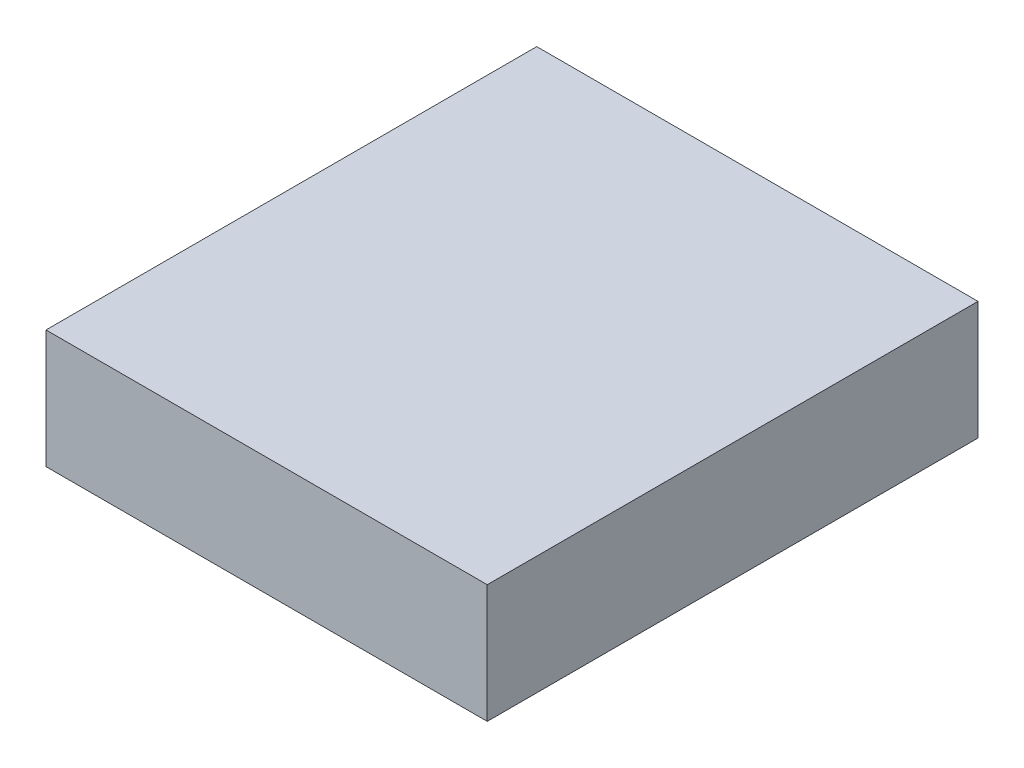
ISO-10303-21;
HEADER;
FILE_DESCRIPTION(('STEP AP214'),'2;1');
FILE_NAME('part.step','',(''),(''),'','','');
FILE_SCHEMA(('AUTOMOTIVE_DESIGN { 1 0 10303 214 1 1 1 1 }'));
ENDSEC;
DATA;
#1=APPLICATION_CONTEXT('core data for automotive mechanical design processes');
#2=APPLICATION_PROTOCOL_DEFINITION('international standard','automotive_design',2000,#1);
#3=PRODUCT_CONTEXT('',#1,'mechanical');
#4=PRODUCT('Part','Part','',(#3));
#5=PRODUCT_RELATED_PRODUCT_CATEGORY('part','',(#4));
#6=PRODUCT_DEFINITION_FORMATION('','',#4);
#7=PRODUCT_DEFINITION_CONTEXT('part definition',#1,'design');
#8=PRODUCT_DEFINITION('design','',#6,#7);
#9=PRODUCT_DEFINITION_SHAPE('','',#8);
#10=(LENGTH_UNIT() NAMED_UNIT(*) SI_UNIT(.MILLI.,.METRE.));
#11=(NAMED_UNIT(*) PLANE_ANGLE_UNIT() SI_UNIT($,.RADIAN.));
#12=(NAMED_UNIT(*) SI_UNIT($,.STERADIAN.) SOLID_ANGLE_UNIT());
#13=UNCERTAINTY_MEASURE_WITH_UNIT(LENGTH_MEASURE(1.E-05),#10,'distance_accuracy_value','');
#14=(GEOMETRIC_REPRESENTATION_CONTEXT(3) GLOBAL_UNCERTAINTY_ASSIGNED_CONTEXT((#13)) GLOBAL_UNIT_ASSIGNED_CONTEXT((#10,
#11,#12)) REPRESENTATION_CONTEXT('',''));
#15=CARTESIAN_POINT('',(0.,0.,0.));
#16=DIRECTION('',(0.,0.,1.));
#17=DIRECTION('',(1.,0.,0.));
#18=AXIS2_PLACEMENT_3D('',#15,#16,#17);
#19=CARTESIAN_POINT('',(26.035,6.985,28.956));
#20=DIRECTION('',(-1.,0.,0.));
#21=DIRECTION('',(0.,0.,1.));
#22=AXIS2_PLACEMENT_3D('',#19,#20,#21);
#23=PLANE('',#22);
#24=DIRECTION('',(0.,0.,-1.));
#25=VECTOR('',#24,1.);
#26=CARTESIAN_POINT('',(26.035,-6.985,28.956));
#27=LINE('',#26,#25);
#28=CARTESIAN_POINT('',(26.035,-6.985,28.956));
#29=VERTEX_POINT('',#28);
#30=CARTESIAN_POINT('',(26.035,-6.985,-28.956));
#31=VERTEX_POINT('',#30);
#32=EDGE_CURVE('E113',#29,#31,#27,.T.);
#33=ORIENTED_EDGE('',*,*,#32,.T.);
#34=DIRECTION('',(0.,-1.,0.));
#35=VECTOR('',#34,1.);
#36=CARTESIAN_POINT('',(26.035,6.985,-28.956));
#37=LINE('',#36,#35);
#38=CARTESIAN_POINT('',(26.035,6.985,-28.956));
#39=VERTEX_POINT('',#38);
#40=EDGE_CURVE('E11',#39,#31,#37,.T.);
#41=ORIENTED_EDGE('',*,*,#40,.F.);
#42=DIRECTION('',(0.,0.,-1.));
#43=VECTOR('',#42,1.);
#44=CARTESIAN_POINT('',(26.035,6.985,28.956));
#45=LINE('',#44,#43);
#46=CARTESIAN_POINT('',(26.035,6.985,28.956));
#47=VERTEX_POINT('',#46);
#48=EDGE_CURVE('E97',#47,#39,#45,.T.);
#49=ORIENTED_EDGE('',*,*,#48,.F.);
#50=DIRECTION('',(0.,-1.,0.));
#51=VECTOR('',#50,1.);
#52=CARTESIAN_POINT('',(26.035,6.985,28.956));
#53=LINE('',#52,#51);
#54=EDGE_CURVE('E109',#47,#29,#53,.T.);
#55=ORIENTED_EDGE('',*,*,#54,.T.);
#56=EDGE_LOOP('',(#33,#41,#49,#55));
#57=FACE_BOUND('',#56,.T.);
#58=ADVANCED_FACE('F45',(#57),#23,.F.);
#59=CARTESIAN_POINT('',(-26.035,6.985,-28.956));
#60=DIRECTION('',(0.,0.,1.));
#61=DIRECTION('',(1.,0.,0.));
#62=AXIS2_PLACEMENT_3D('',#59,#60,#61);
#63=PLANE('',#62);
#64=DIRECTION('',(-1.,0.,0.));
#65=VECTOR('',#64,1.);
#66=CARTESIAN_POINT('',(-26.035,-6.985,-28.956));
#67=LINE('',#66,#65);
#68=CARTESIAN_POINT('',(-26.035,-6.985,-28.956));
#69=VERTEX_POINT('',#68);
#70=EDGE_CURVE('E102',#31,#69,#67,.T.);
#71=ORIENTED_EDGE('',*,*,#70,.T.);
#72=DIRECTION('',(0.,-1.,0.));
#73=VECTOR('',#72,1.);
#74=CARTESIAN_POINT('',(-26.035,6.985,-28.956));
#75=LINE('',#74,#73);
#76=CARTESIAN_POINT('',(-26.035,6.985,-28.956));
#77=VERTEX_POINT('',#76);
#78=EDGE_CURVE('E54',#77,#69,#75,.T.);
#79=ORIENTED_EDGE('',*,*,#78,.F.);
#80=DIRECTION('',(-1.,0.,0.));
#81=VECTOR('',#80,1.);
#82=CARTESIAN_POINT('',(-26.035,6.985,-28.956));
#83=LINE('',#82,#81);
#84=EDGE_CURVE('E92',#39,#77,#83,.T.);
#85=ORIENTED_EDGE('',*,*,#84,.F.);
#86=ORIENTED_EDGE('',*,*,#40,.T.);
#87=EDGE_LOOP('',(#71,#79,#85,#86));
#88=FACE_BOUND('',#87,.T.);
#89=ADVANCED_FACE('F101',(#88),#63,.F.);
#90=CARTESIAN_POINT('',(-26.035,6.985,28.956));
#91=DIRECTION('',(1.,0.,0.));
#92=DIRECTION('',(0.,0.,-1.));
#93=AXIS2_PLACEMENT_3D('',#90,#91,#92);
#94=PLANE('',#93);
#95=DIRECTION('',(0.,0.,1.));
#96=VECTOR('',#95,1.);
#97=CARTESIAN_POINT('',(-26.035,-6.985,28.956));
#98=LINE('',#97,#96);
#99=CARTESIAN_POINT('',(-26.035,-6.985,28.956));
#100=VERTEX_POINT('',#99);
#101=EDGE_CURVE('E79',#69,#100,#98,.T.);
#102=ORIENTED_EDGE('',*,*,#101,.T.);
#103=DIRECTION('',(0.,-1.,0.));
#104=VECTOR('',#103,1.);
#105=CARTESIAN_POINT('',(-26.035,6.985,28.956));
#106=LINE('',#105,#104);
#107=CARTESIAN_POINT('',(-26.035,6.985,28.956));
#108=VERTEX_POINT('',#107);
#109=EDGE_CURVE('E104',#108,#100,#106,.T.);
#110=ORIENTED_EDGE('',*,*,#109,.F.);
#111=DIRECTION('',(0.,0.,1.));
#112=VECTOR('',#111,1.);
#113=CARTESIAN_POINT('',(-26.035,6.985,28.956));
#114=LINE('',#113,#112);
#115=EDGE_CURVE('E95',#77,#108,#114,.T.);
#116=ORIENTED_EDGE('',*,*,#115,.F.);
#117=ORIENTED_EDGE('',*,*,#78,.T.);
#118=EDGE_LOOP('',(#102,#110,#116,#117));
#119=FACE_BOUND('',#118,.T.);
#120=ADVANCED_FACE('F105',(#119),#94,.F.);
#121=CARTESIAN_POINT('',(-26.035,6.985,28.956));
#122=DIRECTION('',(0.,0.,-1.));
#123=DIRECTION('',(-1.,0.,0.));
#124=AXIS2_PLACEMENT_3D('',#121,#122,#123);
#125=PLANE('',#124);
#126=DIRECTION('',(1.,0.,0.));
#127=VECTOR('',#126,1.);
#128=CARTESIAN_POINT('',(-26.035,-6.985,28.956));
#129=LINE('',#128,#127);
#130=EDGE_CURVE('E85',#100,#29,#129,.T.);
#131=ORIENTED_EDGE('',*,*,#130,.T.);
#132=ORIENTED_EDGE('',*,*,#54,.F.);
#133=DIRECTION('',(1.,0.,0.));
#134=VECTOR('',#133,1.);
#135=CARTESIAN_POINT('',(-26.035,6.985,28.956));
#136=LINE('',#135,#134);
#137=EDGE_CURVE('E62',#108,#47,#136,.T.);
#138=ORIENTED_EDGE('',*,*,#137,.F.);
#139=ORIENTED_EDGE('',*,*,#109,.T.);
#140=EDGE_LOOP('',(#131,#132,#138,#139));
#141=FACE_BOUND('',#140,.T.);
#142=ADVANCED_FACE('F126',(#141),#125,.F.);
#143=CARTESIAN_POINT('',(0.,6.985,0.));
#144=DIRECTION('',(0.,-1.,0.));
#145=DIRECTION('',(0.,0.,-1.));
#146=AXIS2_PLACEMENT_3D('',#143,#144,#145);
#147=PLANE('',#146);
#148=ORIENTED_EDGE('',*,*,#48,.T.);
#149=ORIENTED_EDGE('',*,*,#84,.T.);
#150=ORIENTED_EDGE('',*,*,#115,.T.);
#151=ORIENTED_EDGE('',*,*,#137,.T.);
#152=EDGE_LOOP('',(#148,#149,#150,#151));
#153=FACE_BOUND('',#152,.T.);
#154=ADVANCED_FACE('F93',(#153),#147,.F.);
#155=CARTESIAN_POINT('',(0.,-6.985,0.));
#156=DIRECTION('',(0.,-1.,0.));
#157=DIRECTION('',(0.,0.,-1.));
#158=AXIS2_PLACEMENT_3D('',#155,#156,#157);
#159=PLANE('',#158);
#160=ORIENTED_EDGE('',*,*,#32,.F.);
#161=ORIENTED_EDGE('',*,*,#130,.F.);
#162=ORIENTED_EDGE('',*,*,#101,.F.);
#163=ORIENTED_EDGE('',*,*,#70,.F.);
#164=EDGE_LOOP('',(#160,#161,#162,#163));
#165=FACE_BOUND('',#164,.T.);
#166=ADVANCED_FACE('F129',(#165),#159,.T.);
#167=CLOSED_SHELL('',(#58,#89,#120,#142,#154,#166));
#168=MANIFOLD_SOLID_BREP('B2',#167);
#169=ADVANCED_BREP_SHAPE_REPRESENTATION('',(#18,#168),#14);
#170=SHAPE_DEFINITION_REPRESENTATION(#9,#169);
ENDSEC;
END-ISO-10303-21;
